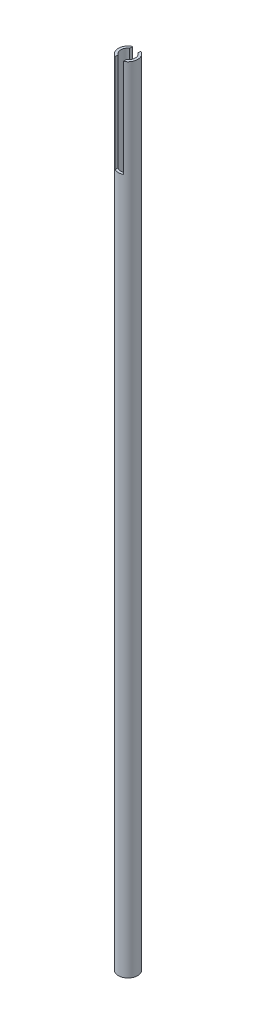
ISO-10303-21;
HEADER;
FILE_DESCRIPTION(('STEP AP214'),'2;1');
FILE_NAME('part.step','',(''),(''),'','','');
FILE_SCHEMA(('AUTOMOTIVE_DESIGN { 1 0 10303 214 1 1 1 1 }'));
ENDSEC;
DATA;
#1=APPLICATION_CONTEXT('core data for automotive mechanical design processes');
#2=APPLICATION_PROTOCOL_DEFINITION('international standard','automotive_design',2000,#1);
#3=PRODUCT_CONTEXT('',#1,'mechanical');
#4=PRODUCT('Part','Part','',(#3));
#5=PRODUCT_RELATED_PRODUCT_CATEGORY('part','',(#4));
#6=PRODUCT_DEFINITION_FORMATION('','',#4);
#7=PRODUCT_DEFINITION_CONTEXT('part definition',#1,'design');
#8=PRODUCT_DEFINITION('design','',#6,#7);
#9=PRODUCT_DEFINITION_SHAPE('','',#8);
#10=(LENGTH_UNIT() NAMED_UNIT(*) SI_UNIT(.MILLI.,.METRE.));
#11=(NAMED_UNIT(*) PLANE_ANGLE_UNIT() SI_UNIT($,.RADIAN.));
#12=(NAMED_UNIT(*) SI_UNIT($,.STERADIAN.) SOLID_ANGLE_UNIT());
#13=UNCERTAINTY_MEASURE_WITH_UNIT(LENGTH_MEASURE(1.E-05),#10,'distance_accuracy_value','');
#14=(GEOMETRIC_REPRESENTATION_CONTEXT(3) GLOBAL_UNCERTAINTY_ASSIGNED_CONTEXT((#13)) GLOBAL_UNIT_ASSIGNED_CONTEXT((#10,
#11,#12)) REPRESENTATION_CONTEXT('',''));
#15=CARTESIAN_POINT('',(0.,0.,0.));
#16=DIRECTION('',(0.,0.,1.));
#17=DIRECTION('',(1.,0.,0.));
#18=AXIS2_PLACEMENT_3D('',#15,#16,#17);
#19=CARTESIAN_POINT('',(0.,879.475,0.));
#20=DIRECTION('',(0.,1.,0.));
#21=DIRECTION('',(0.,0.,1.));
#22=AXIS2_PLACEMENT_3D('',#19,#20,#21);
#23=PLANE('',#22);
#24=DIRECTION('',(0.,0.,-1.));
#25=VECTOR('',#24,1.);
#26=CARTESIAN_POINT('',(4.572,879.475,10.71245));
#27=LINE('',#26,#25);
#28=CARTESIAN_POINT('',(4.572,879.475,9.68779649881747));
#29=VERTEX_POINT('',#28);
#30=CARTESIAN_POINT('',(4.572,879.475,6.48850693534345));
#31=VERTEX_POINT('',#30);
#32=EDGE_CURVE('E105',#29,#31,#27,.T.);
#33=ORIENTED_EDGE('',*,*,#32,.F.);
#34=CARTESIAN_POINT('',(0.,879.475,0.));
#35=DIRECTION('',(0.,1.,0.));
#36=DIRECTION('',(0.,0.,1.));
#37=AXIS2_PLACEMENT_3D('',#34,#35,#36);
#38=CIRCLE('',#37,10.71245);
#39=CARTESIAN_POINT('',(4.572,879.475,-9.68779649881747));
#40=VERTEX_POINT('',#39);
#41=EDGE_CURVE('E116',#29,#40,#38,.T.);
#42=ORIENTED_EDGE('',*,*,#41,.T.);
#43=CARTESIAN_POINT('',(4.572,879.475,-6.48850693534345));
#44=VERTEX_POINT('',#43);
#45=EDGE_CURVE('E120',#44,#40,#27,.T.);
#46=ORIENTED_EDGE('',*,*,#45,.F.);
#47=CARTESIAN_POINT('',(0.,879.475,0.));
#48=DIRECTION('',(0.,1.,0.));
#49=DIRECTION('',(0.,0.,1.));
#50=AXIS2_PLACEMENT_3D('',#47,#48,#49);
#51=CIRCLE('',#50,7.9375);
#52=EDGE_CURVE('E118',#31,#44,#51,.T.);
#53=ORIENTED_EDGE('',*,*,#52,.F.);
#54=EDGE_LOOP('',(#33,#42,#46,#53));
#55=FACE_BOUND('',#54,.T.);
#56=ADVANCED_FACE('F39',(#55),#23,.T.);
#57=DIRECTION('',(0.,0.,1.));
#58=VECTOR('',#57,1.);
#59=CARTESIAN_POINT('',(-4.572,879.475,10.71245));
#60=LINE('',#59,#58);
#61=CARTESIAN_POINT('',(-4.572,879.475,-9.68779649881747));
#62=VERTEX_POINT('',#61);
#63=CARTESIAN_POINT('',(-4.572,879.475,-6.48850693534345));
#64=VERTEX_POINT('',#63);
#65=EDGE_CURVE('E173',#62,#64,#60,.T.);
#66=ORIENTED_EDGE('',*,*,#65,.F.);
#67=CARTESIAN_POINT('',(-4.572,879.475,9.68779649881747));
#68=VERTEX_POINT('',#67);
#69=EDGE_CURVE('E126',#62,#68,#38,.T.);
#70=ORIENTED_EDGE('',*,*,#69,.T.);
#71=CARTESIAN_POINT('',(-4.572,879.475,6.48850693534345));
#72=VERTEX_POINT('',#71);
#73=EDGE_CURVE('E119',#72,#68,#60,.T.);
#74=ORIENTED_EDGE('',*,*,#73,.F.);
#75=EDGE_CURVE('E159',#64,#72,#51,.T.);
#76=ORIENTED_EDGE('',*,*,#75,.F.);
#77=EDGE_LOOP('',(#66,#70,#74,#76));
#78=FACE_BOUND('',#77,.T.);
#79=ADVANCED_FACE('F181',(#78),#23,.T.);
#80=CARTESIAN_POINT('',(0.,0.,0.));
#81=DIRECTION('',(0.,1.,0.));
#82=DIRECTION('',(0.,0.,1.));
#83=AXIS2_PLACEMENT_3D('',#80,#81,#82);
#84=PLANE('',#83);
#85=CARTESIAN_POINT('',(0.,0.,0.));
#86=DIRECTION('',(0.,1.,0.));
#87=DIRECTION('',(0.,0.,1.));
#88=AXIS2_PLACEMENT_3D('',#85,#86,#87);
#89=CIRCLE('',#88,10.71245);
#90=CARTESIAN_POINT('',(0.,0.,10.71245));
#91=VERTEX_POINT('',#90);
#92=EDGE_CURVE('E132',#91,#91,#89,.T.);
#93=ORIENTED_EDGE('',*,*,#92,.F.);
#94=EDGE_LOOP('',(#93));
#95=FACE_BOUND('',#94,.T.);
#96=CARTESIAN_POINT('',(0.,0.,0.));
#97=DIRECTION('',(0.,1.,0.));
#98=DIRECTION('',(0.,0.,1.));
#99=AXIS2_PLACEMENT_3D('',#96,#97,#98);
#100=CIRCLE('',#99,7.9375);
#101=CARTESIAN_POINT('',(0.,0.,7.9375));
#102=VERTEX_POINT('',#101);
#103=EDGE_CURVE('E109',#102,#102,#100,.T.);
#104=ORIENTED_EDGE('',*,*,#103,.T.);
#105=EDGE_LOOP('',(#104));
#106=FACE_BOUND('',#105,.T.);
#107=ADVANCED_FACE('F200',(#95,#106),#84,.F.);
#108=CARTESIAN_POINT('',(0.,879.475,0.));
#109=DIRECTION('',(0.,-1.,0.));
#110=DIRECTION('',(0.,0.,-1.));
#111=AXIS2_PLACEMENT_3D('',#108,#109,#110);
#112=CYLINDRICAL_SURFACE('',#111,10.71245);
#113=ORIENTED_EDGE('',*,*,#41,.F.);
#114=DIRECTION('',(0.,-1.,0.));
#115=VECTOR('',#114,1.);
#116=CARTESIAN_POINT('',(4.572,879.475,9.68779649881747));
#117=LINE('',#116,#115);
#118=CARTESIAN_POINT('',(4.572,770.89,9.68779649881747));
#119=VERTEX_POINT('',#118);
#120=EDGE_CURVE('E102',#29,#119,#117,.T.);
#121=ORIENTED_EDGE('',*,*,#120,.T.);
#122=CARTESIAN_POINT('',(0.,770.89,0.));
#123=DIRECTION('',(0.,-1.,0.));
#124=DIRECTION('',(0.,0.,-1.));
#125=AXIS2_PLACEMENT_3D('',#122,#123,#124);
#126=CIRCLE('',#125,10.71245);
#127=CARTESIAN_POINT('',(-4.572,770.89,9.68779649881747));
#128=VERTEX_POINT('',#127);
#129=EDGE_CURVE('E170',#119,#128,#126,.T.);
#130=ORIENTED_EDGE('',*,*,#129,.T.);
#131=DIRECTION('',(0.,-1.,0.));
#132=VECTOR('',#131,1.);
#133=CARTESIAN_POINT('',(-4.572,879.475,9.68779649881747));
#134=LINE('',#133,#132);
#135=EDGE_CURVE('E152',#128,#68,#134,.F.);
#136=ORIENTED_EDGE('',*,*,#135,.T.);
#137=ORIENTED_EDGE('',*,*,#69,.F.);
#138=DIRECTION('',(0.,-1.,0.));
#139=VECTOR('',#138,1.);
#140=CARTESIAN_POINT('',(-4.572,879.475,-9.68779649881747));
#141=LINE('',#140,#139);
#142=CARTESIAN_POINT('',(-4.572,770.89,-9.68779649881747));
#143=VERTEX_POINT('',#142);
#144=EDGE_CURVE('E166',#62,#143,#141,.T.);
#145=ORIENTED_EDGE('',*,*,#144,.T.);
#146=CARTESIAN_POINT('',(4.572,770.89,-9.68779649881747));
#147=VERTEX_POINT('',#146);
#148=EDGE_CURVE('E171',#143,#147,#126,.T.);
#149=ORIENTED_EDGE('',*,*,#148,.T.);
#150=DIRECTION('',(0.,-1.,0.));
#151=VECTOR('',#150,1.);
#152=CARTESIAN_POINT('',(4.572,879.475,-9.68779649881747));
#153=LINE('',#152,#151);
#154=EDGE_CURVE('E110',#147,#40,#153,.F.);
#155=ORIENTED_EDGE('',*,*,#154,.T.);
#156=EDGE_LOOP('',(#113,#121,#130,#136,#137,#145,#149,#155));
#157=FACE_BOUND('',#156,.T.);
#158=ORIENTED_EDGE('',*,*,#92,.T.);
#159=EDGE_LOOP('',(#158));
#160=FACE_BOUND('',#159,.T.);
#161=ADVANCED_FACE('F41',(#157,#160),#112,.T.);
#162=CARTESIAN_POINT('',(0.,879.475,0.));
#163=DIRECTION('',(0.,-1.,0.));
#164=DIRECTION('',(0.,0.,-1.));
#165=AXIS2_PLACEMENT_3D('',#162,#163,#164);
#166=CYLINDRICAL_SURFACE('',#165,7.9375);
#167=DIRECTION('',(0.,-1.,0.));
#168=VECTOR('',#167,1.);
#169=CARTESIAN_POINT('',(4.572,879.475,6.48850693534345));
#170=LINE('',#169,#168);
#171=CARTESIAN_POINT('',(4.572,770.89,6.48850693534345));
#172=VERTEX_POINT('',#171);
#173=EDGE_CURVE('E11',#31,#172,#170,.T.);
#174=ORIENTED_EDGE('',*,*,#173,.F.);
#175=ORIENTED_EDGE('',*,*,#52,.T.);
#176=DIRECTION('',(0.,-1.,0.));
#177=VECTOR('',#176,1.);
#178=CARTESIAN_POINT('',(4.572,879.475,-6.48850693534345));
#179=LINE('',#178,#177);
#180=CARTESIAN_POINT('',(4.572,770.89,-6.48850693534345));
#181=VERTEX_POINT('',#180);
#182=EDGE_CURVE('E139',#181,#44,#179,.F.);
#183=ORIENTED_EDGE('',*,*,#182,.F.);
#184=CARTESIAN_POINT('',(0.,770.89,0.));
#185=DIRECTION('',(0.,-1.,0.));
#186=DIRECTION('',(0.,0.,-1.));
#187=AXIS2_PLACEMENT_3D('',#184,#185,#186);
#188=CIRCLE('',#187,7.9375);
#189=CARTESIAN_POINT('',(-4.572,770.89,-6.48850693534345));
#190=VERTEX_POINT('',#189);
#191=EDGE_CURVE('E125',#190,#181,#188,.T.);
#192=ORIENTED_EDGE('',*,*,#191,.F.);
#193=DIRECTION('',(0.,-1.,0.));
#194=VECTOR('',#193,1.);
#195=CARTESIAN_POINT('',(-4.572,879.475,-6.48850693534345));
#196=LINE('',#195,#194);
#197=EDGE_CURVE('E128',#64,#190,#196,.T.);
#198=ORIENTED_EDGE('',*,*,#197,.F.);
#199=ORIENTED_EDGE('',*,*,#75,.T.);
#200=DIRECTION('',(0.,-1.,0.));
#201=VECTOR('',#200,1.);
#202=CARTESIAN_POINT('',(-4.572,879.475,6.48850693534345));
#203=LINE('',#202,#201);
#204=CARTESIAN_POINT('',(-4.572,770.89,6.48850693534345));
#205=VERTEX_POINT('',#204);
#206=EDGE_CURVE('E47',#205,#72,#203,.F.);
#207=ORIENTED_EDGE('',*,*,#206,.F.);
#208=EDGE_CURVE('E130',#172,#205,#188,.T.);
#209=ORIENTED_EDGE('',*,*,#208,.F.);
#210=EDGE_LOOP('',(#174,#175,#183,#192,#198,#199,#207,#209));
#211=FACE_BOUND('',#210,.T.);
#212=ORIENTED_EDGE('',*,*,#103,.F.);
#213=EDGE_LOOP('',(#212));
#214=FACE_BOUND('',#213,.T.);
#215=ADVANCED_FACE('F155',(#211,#214),#166,.F.);
#216=CARTESIAN_POINT('',(0.,770.89,0.));
#217=DIRECTION('',(0.,-1.,0.));
#218=DIRECTION('',(0.,0.,-1.));
#219=AXIS2_PLACEMENT_3D('',#216,#217,#218);
#220=PLANE('',#219);
#221=ORIENTED_EDGE('',*,*,#148,.F.);
#222=DIRECTION('',(0.,0.,1.));
#223=VECTOR('',#222,1.);
#224=CARTESIAN_POINT('',(-4.572,770.89,10.71245));
#225=LINE('',#224,#223);
#226=EDGE_CURVE('E61',#143,#190,#225,.T.);
#227=ORIENTED_EDGE('',*,*,#226,.T.);
#228=ORIENTED_EDGE('',*,*,#191,.T.);
#229=DIRECTION('',(0.,0.,-1.));
#230=VECTOR('',#229,1.);
#231=CARTESIAN_POINT('',(4.572,770.89,10.71245));
#232=LINE('',#231,#230);
#233=EDGE_CURVE('E175',#181,#147,#232,.T.);
#234=ORIENTED_EDGE('',*,*,#233,.T.);
#235=EDGE_LOOP('',(#221,#227,#228,#234));
#236=FACE_BOUND('',#235,.T.);
#237=ADVANCED_FACE('F185',(#236),#220,.F.);
#238=CARTESIAN_POINT('',(-4.572,770.89,10.71245));
#239=DIRECTION('',(-1.,0.,0.));
#240=DIRECTION('',(0.,0.,1.));
#241=AXIS2_PLACEMENT_3D('',#238,#239,#240);
#242=PLANE('',#241);
#243=ORIENTED_EDGE('',*,*,#65,.T.);
#244=ORIENTED_EDGE('',*,*,#197,.T.);
#245=ORIENTED_EDGE('',*,*,#226,.F.);
#246=ORIENTED_EDGE('',*,*,#144,.F.);
#247=EDGE_LOOP('',(#243,#244,#245,#246));
#248=FACE_BOUND('',#247,.T.);
#249=ADVANCED_FACE('F179',(#248),#242,.F.);
#250=CARTESIAN_POINT('',(4.572,770.89,10.71245));
#251=DIRECTION('',(1.,0.,0.));
#252=DIRECTION('',(0.,0.,-1.));
#253=AXIS2_PLACEMENT_3D('',#250,#251,#252);
#254=PLANE('',#253);
#255=ORIENTED_EDGE('',*,*,#233,.F.);
#256=ORIENTED_EDGE('',*,*,#182,.T.);
#257=ORIENTED_EDGE('',*,*,#45,.T.);
#258=ORIENTED_EDGE('',*,*,#154,.F.);
#259=EDGE_LOOP('',(#255,#256,#257,#258));
#260=FACE_BOUND('',#259,.T.);
#261=ADVANCED_FACE('F183',(#260),#254,.F.);
#262=ORIENTED_EDGE('',*,*,#32,.T.);
#263=ORIENTED_EDGE('',*,*,#173,.T.);
#264=EDGE_CURVE('E54',#119,#172,#232,.T.);
#265=ORIENTED_EDGE('',*,*,#264,.F.);
#266=ORIENTED_EDGE('',*,*,#120,.F.);
#267=EDGE_LOOP('',(#262,#263,#265,#266));
#268=FACE_BOUND('',#267,.T.);
#269=ADVANCED_FACE('F104',(#268),#254,.F.);
#270=EDGE_CURVE('E147',#205,#128,#225,.T.);
#271=ORIENTED_EDGE('',*,*,#270,.F.);
#272=ORIENTED_EDGE('',*,*,#206,.T.);
#273=ORIENTED_EDGE('',*,*,#73,.T.);
#274=ORIENTED_EDGE('',*,*,#135,.F.);
#275=EDGE_LOOP('',(#271,#272,#273,#274));
#276=FACE_BOUND('',#275,.T.);
#277=ADVANCED_FACE('F150',(#276),#242,.F.);
#278=ORIENTED_EDGE('',*,*,#264,.T.);
#279=ORIENTED_EDGE('',*,*,#208,.T.);
#280=ORIENTED_EDGE('',*,*,#270,.T.);
#281=ORIENTED_EDGE('',*,*,#129,.F.);
#282=EDGE_LOOP('',(#278,#279,#280,#281));
#283=FACE_BOUND('',#282,.T.);
#284=ADVANCED_FACE('F146',(#283),#220,.F.);
#285=CLOSED_SHELL('',(#56,#79,#107,#161,#215,#237,#249,#261,#269,#277,#284));
#286=MANIFOLD_SOLID_BREP('B2',#285);
#287=ADVANCED_BREP_SHAPE_REPRESENTATION('',(#18,#286),#14);
#288=SHAPE_DEFINITION_REPRESENTATION(#9,#287);
ENDSEC;
END-ISO-10303-21;
